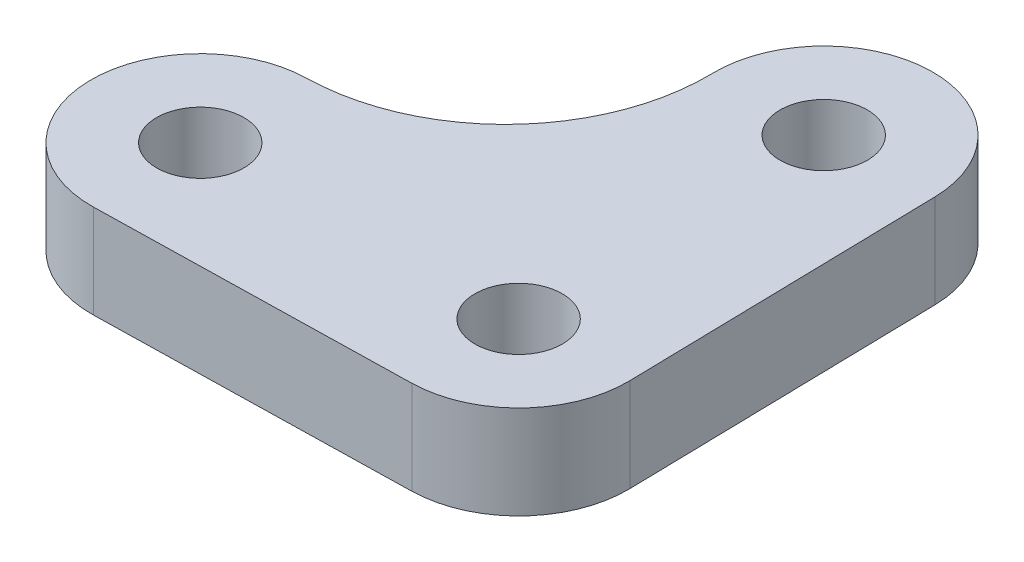
ISO-10303-21;
HEADER;
FILE_DESCRIPTION(('STEP AP214'),'2;1');
FILE_NAME('part.step','',(''),(''),'','','');
FILE_SCHEMA(('AUTOMOTIVE_DESIGN { 1 0 10303 214 1 1 1 1 }'));
ENDSEC;
DATA;
#1=APPLICATION_CONTEXT('core data for automotive mechanical design processes');
#2=APPLICATION_PROTOCOL_DEFINITION('international standard','automotive_design',2000,#1);
#3=PRODUCT_CONTEXT('',#1,'mechanical');
#4=PRODUCT('Part','Part','',(#3));
#5=PRODUCT_RELATED_PRODUCT_CATEGORY('part','',(#4));
#6=PRODUCT_DEFINITION_FORMATION('','',#4);
#7=PRODUCT_DEFINITION_CONTEXT('part definition',#1,'design');
#8=PRODUCT_DEFINITION('design','',#6,#7);
#9=PRODUCT_DEFINITION_SHAPE('','',#8);
#10=(LENGTH_UNIT() NAMED_UNIT(*) SI_UNIT(.MILLI.,.METRE.));
#11=(NAMED_UNIT(*) PLANE_ANGLE_UNIT() SI_UNIT($,.RADIAN.));
#12=(NAMED_UNIT(*) SI_UNIT($,.STERADIAN.) SOLID_ANGLE_UNIT());
#13=UNCERTAINTY_MEASURE_WITH_UNIT(LENGTH_MEASURE(1.E-05),#10,'distance_accuracy_value','');
#14=(GEOMETRIC_REPRESENTATION_CONTEXT(3) GLOBAL_UNCERTAINTY_ASSIGNED_CONTEXT((#13)) GLOBAL_UNIT_ASSIGNED_CONTEXT((#10,
#11,#12)) REPRESENTATION_CONTEXT('',''));
#15=CARTESIAN_POINT('',(0.,0.,0.));
#16=DIRECTION('',(0.,0.,1.));
#17=DIRECTION('',(1.,0.,0.));
#18=AXIS2_PLACEMENT_3D('',#15,#16,#17);
#19=CARTESIAN_POINT('',(4.99887361908589,3.,4.89274850232702));
#20=DIRECTION('',(0.,1.,0.));
#21=DIRECTION('',(0.,0.,1.));
#22=AXIS2_PLACEMENT_3D('',#19,#20,#21);
#23=PLANE('',#22);
#24=CARTESIAN_POINT('',(4.99887361908589,3.,4.89274850232702));
#25=DIRECTION('',(0.,1.,0.));
#26=DIRECTION('',(0.,0.,1.));
#27=AXIS2_PLACEMENT_3D('',#24,#25,#26);
#28=CIRCLE('',#27,1.4);
#29=CARTESIAN_POINT('',(4.99887361908589,3.,6.29274850232702));
#30=VERTEX_POINT('',#29);
#31=EDGE_CURVE('E213',#30,#30,#28,.T.);
#32=ORIENTED_EDGE('',*,*,#31,.F.);
#33=EDGE_LOOP('',(#32));
#34=FACE_BOUND('',#33,.T.);
#35=CARTESIAN_POINT('',(4.99887361908589,3.,4.89274850232702));
#36=DIRECTION('',(0.,1.,0.));
#37=DIRECTION('',(0.,0.,1.));
#38=AXIS2_PLACEMENT_3D('',#35,#36,#37);
#39=CIRCLE('',#38,3.5);
#40=CARTESIAN_POINT('',(5.07316120081711,3.,8.39196003568715));
#41=VERTEX_POINT('',#40);
#42=CARTESIAN_POINT('',(8.49808515244602,3.,4.81846092059581));
#43=VERTEX_POINT('',#42);
#44=EDGE_CURVE('E152',#41,#43,#39,.T.);
#45=ORIENTED_EDGE('',*,*,#44,.T.);
#46=DIRECTION('',(-0.0212250233517744,0.,-0.999774723817179));
#47=VECTOR('',#46,1.);
#48=CARTESIAN_POINT('',(8.49808515244602,3.,4.81846092059581));
#49=LINE('',#48,#47);
#50=CARTESIAN_POINT('',(8.28583491892827,3.,-5.17928631757598));
#51=VERTEX_POINT('',#50);
#52=EDGE_CURVE('E100',#43,#51,#49,.T.);
#53=ORIENTED_EDGE('',*,*,#52,.T.);
#54=CARTESIAN_POINT('',(4.78662338556814,3.,-5.10499873584477));
#55=DIRECTION('',(0.,1.,0.));
#56=DIRECTION('',(0.,0.,1.));
#57=AXIS2_PLACEMENT_3D('',#54,#55,#56);
#58=CIRCLE('',#57,3.5);
#59=CARTESIAN_POINT('',(1.28741185220801,3.,-5.03071115411356));
#60=VERTEX_POINT('',#59);
#61=EDGE_CURVE('E113',#51,#60,#58,.T.);
#62=ORIENTED_EDGE('',*,*,#61,.T.);
#63=CARTESIAN_POINT('',(-5.21112385260365,3.,-4.89274850232702));
#64=DIRECTION('',(0.,-1.,0.));
#65=DIRECTION('',(0.,0.,1.));
#66=AXIS2_PLACEMENT_3D('',#63,#64,#65);
#67=CIRCLE('',#66,6.5);
#68=CARTESIAN_POINT('',(-5.07316120081711,3.,1.60578720248465));
#69=VERTEX_POINT('',#68);
#70=EDGE_CURVE('E107',#60,#69,#67,.T.);
#71=ORIENTED_EDGE('',*,*,#70,.T.);
#72=CARTESIAN_POINT('',(-4.99887361908589,3.,5.10499873584477));
#73=DIRECTION('',(0.,1.,0.));
#74=DIRECTION('',(0.,0.,1.));
#75=AXIS2_PLACEMENT_3D('',#72,#73,#74);
#76=CIRCLE('',#75,3.5);
#77=CARTESIAN_POINT('',(-4.92458603735468,3.,8.6042102692049));
#78=VERTEX_POINT('',#77);
#79=EDGE_CURVE('E111',#69,#78,#76,.T.);
#80=ORIENTED_EDGE('',*,*,#79,.T.);
#81=DIRECTION('',(0.999774723817179,0.,-0.0212250233517751));
#82=VECTOR('',#81,1.);
#83=CARTESIAN_POINT('',(-4.92458603735468,3.,8.6042102692049));
#84=LINE('',#83,#82);
#85=EDGE_CURVE('E63',#78,#41,#84,.T.);
#86=ORIENTED_EDGE('',*,*,#85,.T.);
#87=EDGE_LOOP('',(#45,#53,#62,#71,#80,#86));
#88=FACE_BOUND('',#87,.T.);
#89=CARTESIAN_POINT('',(4.78662338556814,3.,-5.10499873584477));
#90=DIRECTION('',(0.,1.,0.));
#91=DIRECTION('',(0.,0.,1.));
#92=AXIS2_PLACEMENT_3D('',#89,#90,#91);
#93=CIRCLE('',#92,1.4);
#94=CARTESIAN_POINT('',(4.78662338556814,3.,-3.70499873584477));
#95=VERTEX_POINT('',#94);
#96=EDGE_CURVE('E140',#95,#95,#93,.T.);
#97=ORIENTED_EDGE('',*,*,#96,.F.);
#98=EDGE_LOOP('',(#97));
#99=FACE_BOUND('',#98,.T.);
#100=CARTESIAN_POINT('',(-4.99887361908589,3.,5.10499873584477));
#101=DIRECTION('',(0.,1.,0.));
#102=DIRECTION('',(0.,0.,1.));
#103=AXIS2_PLACEMENT_3D('',#100,#101,#102);
#104=CIRCLE('',#103,1.4);
#105=CARTESIAN_POINT('',(-4.99887361908589,3.,6.50499873584477));
#106=VERTEX_POINT('',#105);
#107=EDGE_CURVE('E202',#106,#106,#104,.T.);
#108=ORIENTED_EDGE('',*,*,#107,.F.);
#109=EDGE_LOOP('',(#108));
#110=FACE_BOUND('',#109,.T.);
#111=ADVANCED_FACE('F45',(#34,#88,#99,#110),#23,.T.);
#112=CARTESIAN_POINT('',(4.99887361908589,0.,4.89274850232702));
#113=DIRECTION('',(0.,1.,0.));
#114=DIRECTION('',(0.,0.,1.));
#115=AXIS2_PLACEMENT_3D('',#112,#113,#114);
#116=PLANE('',#115);
#117=CARTESIAN_POINT('',(4.99887361908589,0.,4.89274850232702));
#118=DIRECTION('',(0.,1.,0.));
#119=DIRECTION('',(0.,0.,1.));
#120=AXIS2_PLACEMENT_3D('',#117,#118,#119);
#121=CIRCLE('',#120,3.5);
#122=CARTESIAN_POINT('',(5.07316120081711,0.,8.39196003568715));
#123=VERTEX_POINT('',#122);
#124=CARTESIAN_POINT('',(8.49808515244602,0.,4.81846092059581));
#125=VERTEX_POINT('',#124);
#126=EDGE_CURVE('E135',#123,#125,#121,.T.);
#127=ORIENTED_EDGE('',*,*,#126,.F.);
#128=DIRECTION('',(0.999774723817179,0.,-0.0212250233517751));
#129=VECTOR('',#128,1.);
#130=CARTESIAN_POINT('',(-4.92458603735468,0.,8.6042102692049));
#131=LINE('',#130,#129);
#132=CARTESIAN_POINT('',(-4.92458603735468,0.,8.6042102692049));
#133=VERTEX_POINT('',#132);
#134=EDGE_CURVE('E92',#133,#123,#131,.T.);
#135=ORIENTED_EDGE('',*,*,#134,.F.);
#136=CARTESIAN_POINT('',(-4.99887361908589,0.,5.10499873584477));
#137=DIRECTION('',(0.,1.,0.));
#138=DIRECTION('',(0.,0.,1.));
#139=AXIS2_PLACEMENT_3D('',#136,#137,#138);
#140=CIRCLE('',#139,3.5);
#141=CARTESIAN_POINT('',(-5.07316120081711,0.,1.60578720248465));
#142=VERTEX_POINT('',#141);
#143=EDGE_CURVE('E86',#142,#133,#140,.T.);
#144=ORIENTED_EDGE('',*,*,#143,.F.);
#145=CARTESIAN_POINT('',(-5.21112385260365,0.,-4.89274850232702));
#146=DIRECTION('',(0.,-1.,0.));
#147=DIRECTION('',(0.,0.,1.));
#148=AXIS2_PLACEMENT_3D('',#145,#146,#147);
#149=CIRCLE('',#148,6.5);
#150=CARTESIAN_POINT('',(1.28741185220801,0.,-5.03071115411356));
#151=VERTEX_POINT('',#150);
#152=EDGE_CURVE('E122',#151,#142,#149,.T.);
#153=ORIENTED_EDGE('',*,*,#152,.F.);
#154=CARTESIAN_POINT('',(4.78662338556814,0.,-5.10499873584477));
#155=DIRECTION('',(0.,1.,0.));
#156=DIRECTION('',(0.,0.,1.));
#157=AXIS2_PLACEMENT_3D('',#154,#155,#156);
#158=CIRCLE('',#157,3.5);
#159=CARTESIAN_POINT('',(8.28583491892827,0.,-5.17928631757598));
#160=VERTEX_POINT('',#159);
#161=EDGE_CURVE('E143',#160,#151,#158,.T.);
#162=ORIENTED_EDGE('',*,*,#161,.F.);
#163=DIRECTION('',(-0.0212250233517744,0.,-0.999774723817179));
#164=VECTOR('',#163,1.);
#165=CARTESIAN_POINT('',(8.49808515244602,0.,4.81846092059581));
#166=LINE('',#165,#164);
#167=EDGE_CURVE('E139',#125,#160,#166,.T.);
#168=ORIENTED_EDGE('',*,*,#167,.F.);
#169=EDGE_LOOP('',(#127,#135,#144,#153,#162,#168));
#170=FACE_BOUND('',#169,.T.);
#171=CARTESIAN_POINT('',(4.78662338556814,0.,-5.10499873584477));
#172=DIRECTION('',(0.,1.,0.));
#173=DIRECTION('',(0.,0.,1.));
#174=AXIS2_PLACEMENT_3D('',#171,#172,#173);
#175=CIRCLE('',#174,1.4);
#176=CARTESIAN_POINT('',(4.78662338556814,0.,-3.70499873584477));
#177=VERTEX_POINT('',#176);
#178=EDGE_CURVE('E217',#177,#177,#175,.T.);
#179=ORIENTED_EDGE('',*,*,#178,.T.);
#180=EDGE_LOOP('',(#179));
#181=FACE_BOUND('',#180,.T.);
#182=CARTESIAN_POINT('',(4.99887361908589,0.,4.89274850232702));
#183=DIRECTION('',(0.,1.,0.));
#184=DIRECTION('',(0.,0.,1.));
#185=AXIS2_PLACEMENT_3D('',#182,#183,#184);
#186=CIRCLE('',#185,1.4);
#187=CARTESIAN_POINT('',(4.99887361908589,0.,6.29274850232702));
#188=VERTEX_POINT('',#187);
#189=EDGE_CURVE('E210',#188,#188,#186,.T.);
#190=ORIENTED_EDGE('',*,*,#189,.T.);
#191=EDGE_LOOP('',(#190));
#192=FACE_BOUND('',#191,.T.);
#193=CARTESIAN_POINT('',(-4.99887361908589,0.,5.10499873584477));
#194=DIRECTION('',(0.,1.,0.));
#195=DIRECTION('',(0.,0.,1.));
#196=AXIS2_PLACEMENT_3D('',#193,#194,#195);
#197=CIRCLE('',#196,1.4);
#198=CARTESIAN_POINT('',(-4.99887361908589,0.,6.50499873584477));
#199=VERTEX_POINT('',#198);
#200=EDGE_CURVE('E205',#199,#199,#197,.T.);
#201=ORIENTED_EDGE('',*,*,#200,.T.);
#202=EDGE_LOOP('',(#201));
#203=FACE_BOUND('',#202,.T.);
#204=ADVANCED_FACE('F165',(#170,#181,#192,#203),#116,.F.);
#205=CARTESIAN_POINT('',(4.99887361908589,3.,4.89274850232702));
#206=DIRECTION('',(0.,-1.,0.));
#207=DIRECTION('',(0.,0.,-1.));
#208=AXIS2_PLACEMENT_3D('',#205,#206,#207);
#209=CYLINDRICAL_SURFACE('',#208,3.5);
#210=ORIENTED_EDGE('',*,*,#126,.T.);
#211=DIRECTION('',(0.,-1.,0.));
#212=VECTOR('',#211,1.);
#213=CARTESIAN_POINT('',(8.49808515244602,3.,4.81846092059581));
#214=LINE('',#213,#212);
#215=EDGE_CURVE('E11',#43,#125,#214,.T.);
#216=ORIENTED_EDGE('',*,*,#215,.F.);
#217=ORIENTED_EDGE('',*,*,#44,.F.);
#218=DIRECTION('',(0.,-1.,0.));
#219=VECTOR('',#218,1.);
#220=CARTESIAN_POINT('',(5.07316120081711,3.,8.39196003568715));
#221=LINE('',#220,#219);
#222=EDGE_CURVE('E131',#41,#123,#221,.T.);
#223=ORIENTED_EDGE('',*,*,#222,.T.);
#224=EDGE_LOOP('',(#210,#216,#217,#223));
#225=FACE_BOUND('',#224,.T.);
#226=ADVANCED_FACE('F47',(#225),#209,.T.);
#227=CARTESIAN_POINT('',(8.49808515244602,3.,4.81846092059581));
#228=DIRECTION('',(-0.999774723817179,0.,0.0212250233517744));
#229=DIRECTION('',(0.0212250233517744,0.,0.999774723817179));
#230=AXIS2_PLACEMENT_3D('',#227,#228,#229);
#231=PLANE('',#230);
#232=ORIENTED_EDGE('',*,*,#167,.T.);
#233=DIRECTION('',(0.,-1.,0.));
#234=VECTOR('',#233,1.);
#235=CARTESIAN_POINT('',(8.28583491892827,3.,-5.17928631757598));
#236=LINE('',#235,#234);
#237=EDGE_CURVE('E55',#51,#160,#236,.T.);
#238=ORIENTED_EDGE('',*,*,#237,.F.);
#239=ORIENTED_EDGE('',*,*,#52,.F.);
#240=ORIENTED_EDGE('',*,*,#215,.T.);
#241=EDGE_LOOP('',(#232,#238,#239,#240));
#242=FACE_BOUND('',#241,.T.);
#243=ADVANCED_FACE('F276',(#242),#231,.F.);
#244=CARTESIAN_POINT('',(4.78662338556814,3.,-5.10499873584477));
#245=DIRECTION('',(0.,-1.,0.));
#246=DIRECTION('',(0.,0.,-1.));
#247=AXIS2_PLACEMENT_3D('',#244,#245,#246);
#248=CYLINDRICAL_SURFACE('',#247,3.5);
#249=ORIENTED_EDGE('',*,*,#161,.T.);
#250=DIRECTION('',(0.,-1.,0.));
#251=VECTOR('',#250,1.);
#252=CARTESIAN_POINT('',(1.28741185220801,3.,-5.03071115411356));
#253=LINE('',#252,#251);
#254=EDGE_CURVE('E124',#60,#151,#253,.T.);
#255=ORIENTED_EDGE('',*,*,#254,.F.);
#256=ORIENTED_EDGE('',*,*,#61,.F.);
#257=ORIENTED_EDGE('',*,*,#237,.T.);
#258=EDGE_LOOP('',(#249,#255,#256,#257));
#259=FACE_BOUND('',#258,.T.);
#260=ADVANCED_FACE('F162',(#259),#248,.T.);
#261=CARTESIAN_POINT('',(-5.21112385260365,3.,-4.89274850232702));
#262=DIRECTION('',(0.,-1.,0.));
#263=DIRECTION('',(0.,0.,-1.));
#264=AXIS2_PLACEMENT_3D('',#261,#262,#263);
#265=CYLINDRICAL_SURFACE('',#264,6.5);
#266=ORIENTED_EDGE('',*,*,#152,.T.);
#267=DIRECTION('',(0.,-1.,0.));
#268=VECTOR('',#267,1.);
#269=CARTESIAN_POINT('',(-5.07316120081711,3.,1.60578720248465));
#270=LINE('',#269,#268);
#271=EDGE_CURVE('E119',#69,#142,#270,.T.);
#272=ORIENTED_EDGE('',*,*,#271,.F.);
#273=ORIENTED_EDGE('',*,*,#70,.F.);
#274=ORIENTED_EDGE('',*,*,#254,.T.);
#275=EDGE_LOOP('',(#266,#272,#273,#274));
#276=FACE_BOUND('',#275,.T.);
#277=ADVANCED_FACE('F120',(#276),#265,.F.);
#278=CARTESIAN_POINT('',(-4.99887361908589,3.,5.10499873584477));
#279=DIRECTION('',(0.,-1.,0.));
#280=DIRECTION('',(0.,0.,-1.));
#281=AXIS2_PLACEMENT_3D('',#278,#279,#280);
#282=CYLINDRICAL_SURFACE('',#281,3.5);
#283=ORIENTED_EDGE('',*,*,#143,.T.);
#284=DIRECTION('',(0.,-1.,0.));
#285=VECTOR('',#284,1.);
#286=CARTESIAN_POINT('',(-4.92458603735468,3.,8.6042102692049));
#287=LINE('',#286,#285);
#288=EDGE_CURVE('E125',#78,#133,#287,.T.);
#289=ORIENTED_EDGE('',*,*,#288,.F.);
#290=ORIENTED_EDGE('',*,*,#79,.F.);
#291=ORIENTED_EDGE('',*,*,#271,.T.);
#292=EDGE_LOOP('',(#283,#289,#290,#291));
#293=FACE_BOUND('',#292,.T.);
#294=ADVANCED_FACE('F127',(#293),#282,.T.);
#295=CARTESIAN_POINT('',(-4.92458603735468,3.,8.6042102692049));
#296=DIRECTION('',(-0.0212250233517751,0.,-0.999774723817179));
#297=DIRECTION('',(-0.999774723817179,0.,0.0212250233517751));
#298=AXIS2_PLACEMENT_3D('',#295,#296,#297);
#299=PLANE('',#298);
#300=ORIENTED_EDGE('',*,*,#134,.T.);
#301=ORIENTED_EDGE('',*,*,#222,.F.);
#302=ORIENTED_EDGE('',*,*,#85,.F.);
#303=ORIENTED_EDGE('',*,*,#288,.T.);
#304=EDGE_LOOP('',(#300,#301,#302,#303));
#305=FACE_BOUND('',#304,.T.);
#306=ADVANCED_FACE('F170',(#305),#299,.F.);
#307=CARTESIAN_POINT('',(4.78662338556814,3.,-5.10499873584477));
#308=DIRECTION('',(0.,-1.,0.));
#309=DIRECTION('',(0.,0.,-1.));
#310=AXIS2_PLACEMENT_3D('',#307,#308,#309);
#311=CYLINDRICAL_SURFACE('',#310,1.4);
#312=ORIENTED_EDGE('',*,*,#96,.T.);
#313=EDGE_LOOP('',(#312));
#314=FACE_BOUND('',#313,.T.);
#315=ORIENTED_EDGE('',*,*,#178,.F.);
#316=EDGE_LOOP('',(#315));
#317=FACE_BOUND('',#316,.T.);
#318=ADVANCED_FACE('F172',(#314,#317),#311,.F.);
#319=CARTESIAN_POINT('',(4.99887361908589,3.,4.89274850232702));
#320=DIRECTION('',(0.,-1.,0.));
#321=DIRECTION('',(0.,0.,-1.));
#322=AXIS2_PLACEMENT_3D('',#319,#320,#321);
#323=CYLINDRICAL_SURFACE('',#322,1.4);
#324=ORIENTED_EDGE('',*,*,#31,.T.);
#325=EDGE_LOOP('',(#324));
#326=FACE_BOUND('',#325,.T.);
#327=ORIENTED_EDGE('',*,*,#189,.F.);
#328=EDGE_LOOP('',(#327));
#329=FACE_BOUND('',#328,.T.);
#330=ADVANCED_FACE('F178',(#326,#329),#323,.F.);
#331=CARTESIAN_POINT('',(-4.99887361908589,3.,5.10499873584477));
#332=DIRECTION('',(0.,-1.,0.));
#333=DIRECTION('',(0.,0.,-1.));
#334=AXIS2_PLACEMENT_3D('',#331,#332,#333);
#335=CYLINDRICAL_SURFACE('',#334,1.4);
#336=ORIENTED_EDGE('',*,*,#107,.T.);
#337=EDGE_LOOP('',(#336));
#338=FACE_BOUND('',#337,.T.);
#339=ORIENTED_EDGE('',*,*,#200,.F.);
#340=EDGE_LOOP('',(#339));
#341=FACE_BOUND('',#340,.T.);
#342=ADVANCED_FACE('F193',(#338,#341),#335,.F.);
#343=CLOSED_SHELL('',(#111,#204,#226,#243,#260,#277,#294,#306,#318,#330,#342));
#344=MANIFOLD_SOLID_BREP('B2',#343);
#345=ADVANCED_BREP_SHAPE_REPRESENTATION('',(#18,#344),#14);
#346=SHAPE_DEFINITION_REPRESENTATION(#9,#345);
ENDSEC;
END-ISO-10303-21;
